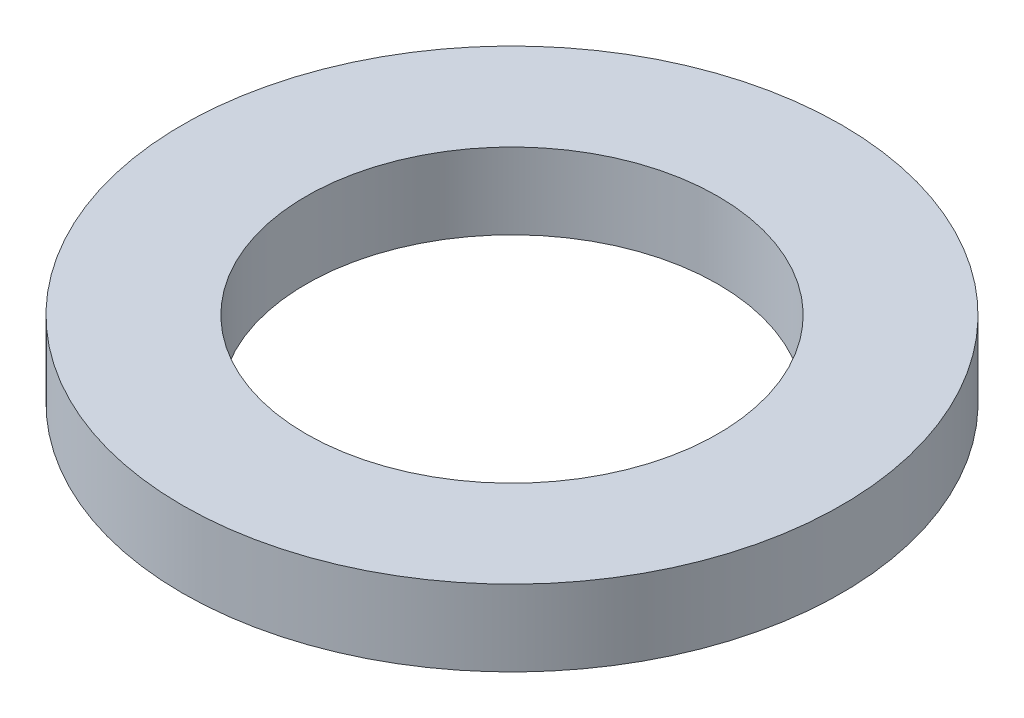
ISO-10303-21;
HEADER;
FILE_DESCRIPTION(('STEP AP214'),'2;1');
FILE_NAME('part.step','',(''),(''),'','','');
FILE_SCHEMA(('AUTOMOTIVE_DESIGN { 1 0 10303 214 1 1 1 1 }'));
ENDSEC;
DATA;
#1=APPLICATION_CONTEXT('core data for automotive mechanical design processes');
#2=APPLICATION_PROTOCOL_DEFINITION('international standard','automotive_design',2000,#1);
#3=PRODUCT_CONTEXT('',#1,'mechanical');
#4=PRODUCT('Part','Part','',(#3));
#5=PRODUCT_RELATED_PRODUCT_CATEGORY('part','',(#4));
#6=PRODUCT_DEFINITION_FORMATION('','',#4);
#7=PRODUCT_DEFINITION_CONTEXT('part definition',#1,'design');
#8=PRODUCT_DEFINITION('design','',#6,#7);
#9=PRODUCT_DEFINITION_SHAPE('','',#8);
#10=(LENGTH_UNIT() NAMED_UNIT(*) SI_UNIT(.MILLI.,.METRE.));
#11=(NAMED_UNIT(*) PLANE_ANGLE_UNIT() SI_UNIT($,.RADIAN.));
#12=(NAMED_UNIT(*) SI_UNIT($,.STERADIAN.) SOLID_ANGLE_UNIT());
#13=UNCERTAINTY_MEASURE_WITH_UNIT(LENGTH_MEASURE(1.E-05),#10,'distance_accuracy_value','');
#14=(GEOMETRIC_REPRESENTATION_CONTEXT(3) GLOBAL_UNCERTAINTY_ASSIGNED_CONTEXT((#13)) GLOBAL_UNIT_ASSIGNED_CONTEXT((#10,
#11,#12)) REPRESENTATION_CONTEXT('',''));
#15=CARTESIAN_POINT('',(0.,0.,0.));
#16=DIRECTION('',(0.,0.,1.));
#17=DIRECTION('',(1.,0.,0.));
#18=AXIS2_PLACEMENT_3D('',#15,#16,#17);
#19=CARTESIAN_POINT('',(0.,6.15,0.));
#20=DIRECTION('',(0.,1.,0.));
#21=DIRECTION('',(0.,0.,1.));
#22=AXIS2_PLACEMENT_3D('',#19,#20,#21);
#23=PLANE('',#22);
#24=CARTESIAN_POINT('',(0.,6.15,0.));
#25=DIRECTION('',(0.,1.,0.));
#26=DIRECTION('',(0.,0.,1.));
#27=AXIS2_PLACEMENT_3D('',#24,#25,#26);
#28=CIRCLE('',#27,26.65);
#29=CARTESIAN_POINT('',(0.,6.15,26.65));
#30=VERTEX_POINT('',#29);
#31=EDGE_CURVE('E10',#30,#30,#28,.T.);
#32=ORIENTED_EDGE('',*,*,#31,.T.);
#33=EDGE_LOOP('',(#32));
#34=FACE_BOUND('',#33,.T.);
#35=CARTESIAN_POINT('',(0.,6.15,0.));
#36=DIRECTION('',(0.,1.,0.));
#37=DIRECTION('',(0.,0.,1.));
#38=AXIS2_PLACEMENT_3D('',#35,#36,#37);
#39=CIRCLE('',#38,16.65);
#40=CARTESIAN_POINT('',(0.,6.15,16.65));
#41=VERTEX_POINT('',#40);
#42=EDGE_CURVE('E44',#41,#41,#39,.T.);
#43=ORIENTED_EDGE('',*,*,#42,.F.);
#44=EDGE_LOOP('',(#43));
#45=FACE_BOUND('',#44,.T.);
#46=ADVANCED_FACE('F33',(#34,#45),#23,.T.);
#47=CARTESIAN_POINT('',(0.,0.,0.));
#48=DIRECTION('',(0.,1.,0.));
#49=DIRECTION('',(0.,0.,1.));
#50=AXIS2_PLACEMENT_3D('',#47,#48,#49);
#51=PLANE('',#50);
#52=CARTESIAN_POINT('',(0.,0.,0.));
#53=DIRECTION('',(0.,1.,0.));
#54=DIRECTION('',(0.,0.,1.));
#55=AXIS2_PLACEMENT_3D('',#52,#53,#54);
#56=CIRCLE('',#55,26.65);
#57=CARTESIAN_POINT('',(0.,0.,26.65));
#58=VERTEX_POINT('',#57);
#59=EDGE_CURVE('E37',#58,#58,#56,.T.);
#60=ORIENTED_EDGE('',*,*,#59,.F.);
#61=EDGE_LOOP('',(#60));
#62=FACE_BOUND('',#61,.T.);
#63=CARTESIAN_POINT('',(0.,0.,0.));
#64=DIRECTION('',(0.,1.,0.));
#65=DIRECTION('',(0.,0.,1.));
#66=AXIS2_PLACEMENT_3D('',#63,#64,#65);
#67=CIRCLE('',#66,16.65);
#68=CARTESIAN_POINT('',(0.,0.,16.65));
#69=VERTEX_POINT('',#68);
#70=EDGE_CURVE('E46',#69,#69,#67,.T.);
#71=ORIENTED_EDGE('',*,*,#70,.T.);
#72=EDGE_LOOP('',(#71));
#73=FACE_BOUND('',#72,.T.);
#74=ADVANCED_FACE('F56',(#62,#73),#51,.F.);
#75=CARTESIAN_POINT('',(0.,6.15,0.));
#76=DIRECTION('',(0.,-1.,0.));
#77=DIRECTION('',(0.,0.,-1.));
#78=AXIS2_PLACEMENT_3D('',#75,#76,#77);
#79=CYLINDRICAL_SURFACE('',#78,26.65);
#80=ORIENTED_EDGE('',*,*,#31,.F.);
#81=EDGE_LOOP('',(#80));
#82=FACE_BOUND('',#81,.T.);
#83=ORIENTED_EDGE('',*,*,#59,.T.);
#84=EDGE_LOOP('',(#83));
#85=FACE_BOUND('',#84,.T.);
#86=ADVANCED_FACE('F35',(#82,#85),#79,.T.);
#87=CARTESIAN_POINT('',(0.,6.15,0.));
#88=DIRECTION('',(0.,-1.,0.));
#89=DIRECTION('',(0.,0.,-1.));
#90=AXIS2_PLACEMENT_3D('',#87,#88,#89);
#91=CYLINDRICAL_SURFACE('',#90,16.65);
#92=ORIENTED_EDGE('',*,*,#42,.T.);
#93=EDGE_LOOP('',(#92));
#94=FACE_BOUND('',#93,.T.);
#95=ORIENTED_EDGE('',*,*,#70,.F.);
#96=EDGE_LOOP('',(#95));
#97=FACE_BOUND('',#96,.T.);
#98=ADVANCED_FACE('F52',(#94,#97),#91,.F.);
#99=CLOSED_SHELL('',(#46,#74,#86,#98));
#100=MANIFOLD_SOLID_BREP('B2',#99);
#101=ADVANCED_BREP_SHAPE_REPRESENTATION('',(#18,#100),#14);
#102=SHAPE_DEFINITION_REPRESENTATION(#9,#101);
ENDSEC;
END-ISO-10303-21;
